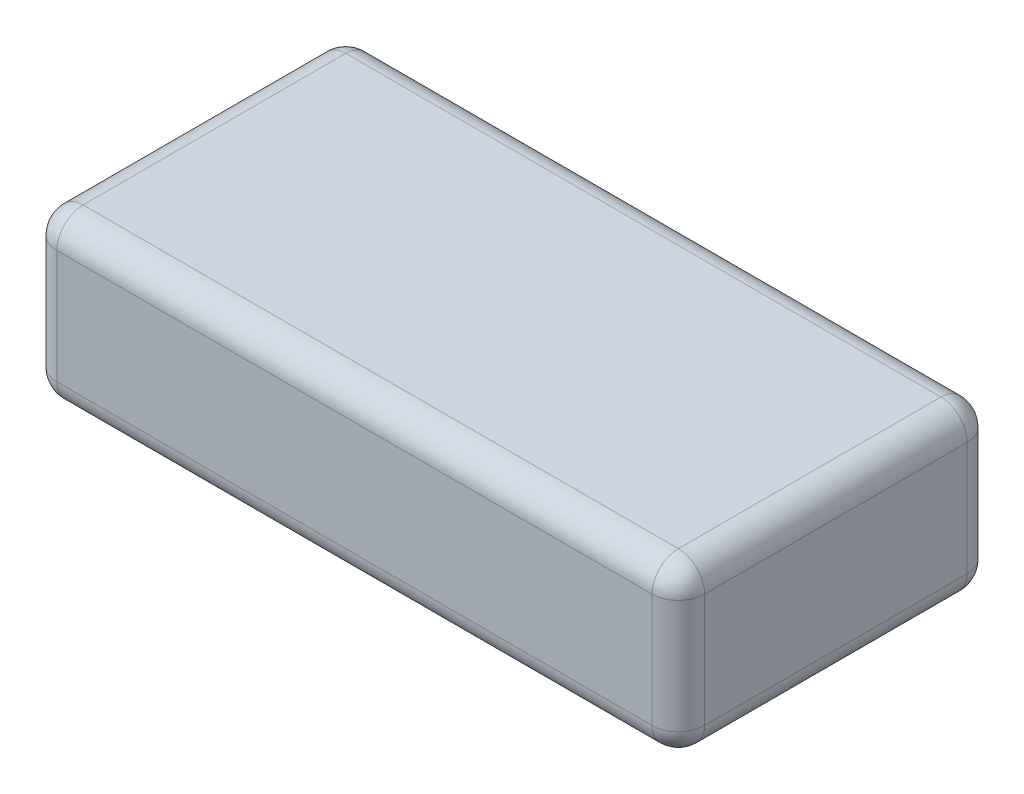
ISO-10303-21;
HEADER;
FILE_DESCRIPTION(('STEP AP214'),'2;1');
FILE_NAME('part.step','',(''),(''),'','','');
FILE_SCHEMA(('AUTOMOTIVE_DESIGN { 1 0 10303 214 1 1 1 1 }'));
ENDSEC;
DATA;
#1=APPLICATION_CONTEXT('core data for automotive mechanical design processes');
#2=APPLICATION_PROTOCOL_DEFINITION('international standard','automotive_design',2000,#1);
#3=PRODUCT_CONTEXT('',#1,'mechanical');
#4=PRODUCT('Part','Part','',(#3));
#5=PRODUCT_RELATED_PRODUCT_CATEGORY('part','',(#4));
#6=PRODUCT_DEFINITION_FORMATION('','',#4);
#7=PRODUCT_DEFINITION_CONTEXT('part definition',#1,'design');
#8=PRODUCT_DEFINITION('design','',#6,#7);
#9=PRODUCT_DEFINITION_SHAPE('','',#8);
#10=(LENGTH_UNIT() NAMED_UNIT(*) SI_UNIT(.MILLI.,.METRE.));
#11=(NAMED_UNIT(*) PLANE_ANGLE_UNIT() SI_UNIT($,.RADIAN.));
#12=(NAMED_UNIT(*) SI_UNIT($,.STERADIAN.) SOLID_ANGLE_UNIT());
#13=UNCERTAINTY_MEASURE_WITH_UNIT(LENGTH_MEASURE(1.E-05),#10,'distance_accuracy_value','');
#14=(GEOMETRIC_REPRESENTATION_CONTEXT(3) GLOBAL_UNCERTAINTY_ASSIGNED_CONTEXT((#13)) GLOBAL_UNIT_ASSIGNED_CONTEXT((#10,
#11,#12)) REPRESENTATION_CONTEXT('',''));
#15=CARTESIAN_POINT('',(0.,0.,0.));
#16=DIRECTION('',(0.,0.,1.));
#17=DIRECTION('',(1.,0.,0.));
#18=AXIS2_PLACEMENT_3D('',#15,#16,#17);
#19=CARTESIAN_POINT('',(37.,19.,18.));
#20=DIRECTION('',(-1.,0.,0.));
#21=DIRECTION('',(0.,0.,1.));
#22=AXIS2_PLACEMENT_3D('',#19,#20,#21);
#23=PLANE('',#22);
#24=DIRECTION('',(0.,0.,-1.));
#25=VECTOR('',#24,1.);
#26=CARTESIAN_POINT('',(37.,3.,-18.));
#27=LINE('',#26,#25);
#28=CARTESIAN_POINT('',(37.,3.,15.));
#29=VERTEX_POINT('',#28);
#30=CARTESIAN_POINT('',(37.,3.,-15.));
#31=VERTEX_POINT('',#30);
#32=EDGE_CURVE('E192',#29,#31,#27,.T.);
#33=ORIENTED_EDGE('',*,*,#32,.T.);
#34=DIRECTION('',(0.,-1.,0.));
#35=VECTOR('',#34,1.);
#36=CARTESIAN_POINT('',(37.,19.,-15.));
#37=LINE('',#36,#35);
#38=CARTESIAN_POINT('',(37.,16.,-15.));
#39=VERTEX_POINT('',#38);
#40=EDGE_CURVE('E195',#31,#39,#37,.F.);
#41=ORIENTED_EDGE('',*,*,#40,.T.);
#42=DIRECTION('',(0.,0.,-1.));
#43=VECTOR('',#42,1.);
#44=CARTESIAN_POINT('',(37.,16.,18.));
#45=LINE('',#44,#43);
#46=CARTESIAN_POINT('',(37.,16.,15.));
#47=VERTEX_POINT('',#46);
#48=EDGE_CURVE('E190',#39,#47,#45,.F.);
#49=ORIENTED_EDGE('',*,*,#48,.T.);
#50=DIRECTION('',(0.,-1.,0.));
#51=VECTOR('',#50,1.);
#52=CARTESIAN_POINT('',(37.,19.,15.));
#53=LINE('',#52,#51);
#54=EDGE_CURVE('E188',#47,#29,#53,.T.);
#55=ORIENTED_EDGE('',*,*,#54,.T.);
#56=EDGE_LOOP('',(#33,#41,#49,#55));
#57=FACE_BOUND('',#56,.T.);
#58=ADVANCED_FACE('F36',(#57),#23,.F.);
#59=CARTESIAN_POINT('',(-37.,19.,-18.));
#60=DIRECTION('',(0.,0.,1.));
#61=DIRECTION('',(1.,0.,0.));
#62=AXIS2_PLACEMENT_3D('',#59,#60,#61);
#63=PLANE('',#62);
#64=DIRECTION('',(-1.,0.,0.));
#65=VECTOR('',#64,1.);
#66=CARTESIAN_POINT('',(-37.,16.,-18.));
#67=LINE('',#66,#65);
#68=CARTESIAN_POINT('',(-34.,16.,-18.));
#69=VERTEX_POINT('',#68);
#70=CARTESIAN_POINT('',(34.,16.,-18.));
#71=VERTEX_POINT('',#70);
#72=EDGE_CURVE('E153',#69,#71,#67,.F.);
#73=ORIENTED_EDGE('',*,*,#72,.T.);
#74=DIRECTION('',(0.,-1.,0.));
#75=VECTOR('',#74,1.);
#76=CARTESIAN_POINT('',(34.,19.,-18.));
#77=LINE('',#76,#75);
#78=CARTESIAN_POINT('',(34.,3.,-18.));
#79=VERTEX_POINT('',#78);
#80=EDGE_CURVE('E157',#71,#79,#77,.T.);
#81=ORIENTED_EDGE('',*,*,#80,.T.);
#82=DIRECTION('',(-1.,0.,0.));
#83=VECTOR('',#82,1.);
#84=CARTESIAN_POINT('',(-37.,3.,-18.));
#85=LINE('',#84,#83);
#86=CARTESIAN_POINT('',(-34.,3.,-18.));
#87=VERTEX_POINT('',#86);
#88=EDGE_CURVE('E129',#79,#87,#85,.T.);
#89=ORIENTED_EDGE('',*,*,#88,.T.);
#90=DIRECTION('',(0.,-1.,0.));
#91=VECTOR('',#90,1.);
#92=CARTESIAN_POINT('',(-34.,19.,-18.));
#93=LINE('',#92,#91);
#94=EDGE_CURVE('E147',#87,#69,#93,.F.);
#95=ORIENTED_EDGE('',*,*,#94,.T.);
#96=EDGE_LOOP('',(#73,#81,#89,#95));
#97=FACE_BOUND('',#96,.T.);
#98=ADVANCED_FACE('F155',(#97),#63,.F.);
#99=CARTESIAN_POINT('',(-37.,19.,18.));
#100=DIRECTION('',(1.,0.,0.));
#101=DIRECTION('',(0.,0.,-1.));
#102=AXIS2_PLACEMENT_3D('',#99,#100,#101);
#103=PLANE('',#102);
#104=DIRECTION('',(0.,0.,1.));
#105=VECTOR('',#104,1.);
#106=CARTESIAN_POINT('',(-37.,16.,18.));
#107=LINE('',#106,#105);
#108=CARTESIAN_POINT('',(-37.,16.,15.));
#109=VERTEX_POINT('',#108);
#110=CARTESIAN_POINT('',(-37.,16.,-15.));
#111=VERTEX_POINT('',#110);
#112=EDGE_CURVE('E172',#109,#111,#107,.F.);
#113=ORIENTED_EDGE('',*,*,#112,.T.);
#114=DIRECTION('',(0.,-1.,0.));
#115=VECTOR('',#114,1.);
#116=CARTESIAN_POINT('',(-37.,19.,-15.));
#117=LINE('',#116,#115);
#118=CARTESIAN_POINT('',(-37.,3.,-15.));
#119=VERTEX_POINT('',#118);
#120=EDGE_CURVE('E177',#111,#119,#117,.T.);
#121=ORIENTED_EDGE('',*,*,#120,.T.);
#122=DIRECTION('',(0.,0.,1.));
#123=VECTOR('',#122,1.);
#124=CARTESIAN_POINT('',(-37.,3.,18.));
#125=LINE('',#124,#123);
#126=CARTESIAN_POINT('',(-37.,3.,15.));
#127=VERTEX_POINT('',#126);
#128=EDGE_CURVE('E174',#119,#127,#125,.T.);
#129=ORIENTED_EDGE('',*,*,#128,.T.);
#130=DIRECTION('',(0.,-1.,0.));
#131=VECTOR('',#130,1.);
#132=CARTESIAN_POINT('',(-37.,19.,15.));
#133=LINE('',#132,#131);
#134=EDGE_CURVE('E170',#127,#109,#133,.F.);
#135=ORIENTED_EDGE('',*,*,#134,.T.);
#136=EDGE_LOOP('',(#113,#121,#129,#135));
#137=FACE_BOUND('',#136,.T.);
#138=ADVANCED_FACE('F330',(#137),#103,.F.);
#139=CARTESIAN_POINT('',(-37.,19.,18.));
#140=DIRECTION('',(0.,0.,-1.));
#141=DIRECTION('',(-1.,0.,0.));
#142=AXIS2_PLACEMENT_3D('',#139,#140,#141);
#143=PLANE('',#142);
#144=DIRECTION('',(1.,0.,0.));
#145=VECTOR('',#144,1.);
#146=CARTESIAN_POINT('',(37.,3.,18.));
#147=LINE('',#146,#145);
#148=CARTESIAN_POINT('',(-34.,3.,18.));
#149=VERTEX_POINT('',#148);
#150=CARTESIAN_POINT('',(34.,3.,18.));
#151=VERTEX_POINT('',#150);
#152=EDGE_CURVE('E183',#149,#151,#147,.T.);
#153=ORIENTED_EDGE('',*,*,#152,.T.);
#154=DIRECTION('',(0.,-1.,0.));
#155=VECTOR('',#154,1.);
#156=CARTESIAN_POINT('',(34.,19.,18.));
#157=LINE('',#156,#155);
#158=CARTESIAN_POINT('',(34.,16.,18.));
#159=VERTEX_POINT('',#158);
#160=EDGE_CURVE('E186',#151,#159,#157,.F.);
#161=ORIENTED_EDGE('',*,*,#160,.T.);
#162=DIRECTION('',(1.,0.,0.));
#163=VECTOR('',#162,1.);
#164=CARTESIAN_POINT('',(-37.,16.,18.));
#165=LINE('',#164,#163);
#166=CARTESIAN_POINT('',(-34.,16.,18.));
#167=VERTEX_POINT('',#166);
#168=EDGE_CURVE('E181',#159,#167,#165,.F.);
#169=ORIENTED_EDGE('',*,*,#168,.T.);
#170=DIRECTION('',(0.,-1.,0.));
#171=VECTOR('',#170,1.);
#172=CARTESIAN_POINT('',(-34.,19.,18.));
#173=LINE('',#172,#171);
#174=EDGE_CURVE('E179',#167,#149,#173,.T.);
#175=ORIENTED_EDGE('',*,*,#174,.T.);
#176=EDGE_LOOP('',(#153,#161,#169,#175));
#177=FACE_BOUND('',#176,.T.);
#178=ADVANCED_FACE('F297',(#177),#143,.F.);
#179=CARTESIAN_POINT('',(0.,19.,0.));
#180=DIRECTION('',(0.,-1.,0.));
#181=DIRECTION('',(0.,0.,-1.));
#182=AXIS2_PLACEMENT_3D('',#179,#180,#181);
#183=PLANE('',#182);
#184=DIRECTION('',(0.,0.,1.));
#185=VECTOR('',#184,1.);
#186=CARTESIAN_POINT('',(-34.,19.,0.));
#187=LINE('',#186,#185);
#188=CARTESIAN_POINT('',(-34.,19.,-15.));
#189=VERTEX_POINT('',#188);
#190=CARTESIAN_POINT('',(-34.,19.,15.));
#191=VERTEX_POINT('',#190);
#192=EDGE_CURVE('E45',#189,#191,#187,.T.);
#193=ORIENTED_EDGE('',*,*,#192,.T.);
#194=DIRECTION('',(1.,0.,0.));
#195=VECTOR('',#194,1.);
#196=CARTESIAN_POINT('',(0.,19.,15.));
#197=LINE('',#196,#195);
#198=CARTESIAN_POINT('',(34.,19.,15.));
#199=VERTEX_POINT('',#198);
#200=EDGE_CURVE('E11',#191,#199,#197,.T.);
#201=ORIENTED_EDGE('',*,*,#200,.T.);
#202=DIRECTION('',(0.,0.,-1.));
#203=VECTOR('',#202,1.);
#204=CARTESIAN_POINT('',(34.,19.,0.));
#205=LINE('',#204,#203);
#206=CARTESIAN_POINT('',(34.,19.,-15.));
#207=VERTEX_POINT('',#206);
#208=EDGE_CURVE('E197',#199,#207,#205,.T.);
#209=ORIENTED_EDGE('',*,*,#208,.T.);
#210=DIRECTION('',(-1.,0.,0.));
#211=VECTOR('',#210,1.);
#212=CARTESIAN_POINT('',(0.,19.,-15.));
#213=LINE('',#212,#211);
#214=EDGE_CURVE('E56',#207,#189,#213,.T.);
#215=ORIENTED_EDGE('',*,*,#214,.T.);
#216=EDGE_LOOP('',(#193,#201,#209,#215));
#217=FACE_BOUND('',#216,.T.);
#218=ADVANCED_FACE('F277',(#217),#183,.F.);
#219=CARTESIAN_POINT('',(0.,0.,0.));
#220=DIRECTION('',(0.,-1.,0.));
#221=DIRECTION('',(0.,0.,-1.));
#222=AXIS2_PLACEMENT_3D('',#219,#220,#221);
#223=PLANE('',#222);
#224=DIRECTION('',(0.,0.,1.));
#225=VECTOR('',#224,1.);
#226=CARTESIAN_POINT('',(-34.,0.,-18.));
#227=LINE('',#226,#225);
#228=CARTESIAN_POINT('',(-34.,0.,15.));
#229=VERTEX_POINT('',#228);
#230=CARTESIAN_POINT('',(-34.,0.,-15.));
#231=VERTEX_POINT('',#230);
#232=EDGE_CURVE('E167',#229,#231,#227,.F.);
#233=ORIENTED_EDGE('',*,*,#232,.T.);
#234=DIRECTION('',(-1.,0.,0.));
#235=VECTOR('',#234,1.);
#236=CARTESIAN_POINT('',(37.,0.,-15.));
#237=LINE('',#236,#235);
#238=CARTESIAN_POINT('',(34.,0.,-15.));
#239=VERTEX_POINT('',#238);
#240=EDGE_CURVE('E131',#231,#239,#237,.F.);
#241=ORIENTED_EDGE('',*,*,#240,.T.);
#242=DIRECTION('',(0.,0.,-1.));
#243=VECTOR('',#242,1.);
#244=CARTESIAN_POINT('',(34.,0.,18.));
#245=LINE('',#244,#243);
#246=CARTESIAN_POINT('',(34.,0.,15.));
#247=VERTEX_POINT('',#246);
#248=EDGE_CURVE('E160',#239,#247,#245,.F.);
#249=ORIENTED_EDGE('',*,*,#248,.T.);
#250=DIRECTION('',(1.,0.,0.));
#251=VECTOR('',#250,1.);
#252=CARTESIAN_POINT('',(-37.,0.,15.));
#253=LINE('',#252,#251);
#254=EDGE_CURVE('E165',#247,#229,#253,.F.);
#255=ORIENTED_EDGE('',*,*,#254,.T.);
#256=EDGE_LOOP('',(#233,#241,#249,#255));
#257=FACE_BOUND('',#256,.T.);
#258=ADVANCED_FACE('F358',(#257),#223,.T.);
#259=CARTESIAN_POINT('',(0.,16.,15.));
#260=DIRECTION('',(1.,0.,0.));
#261=DIRECTION('',(0.,0.,-1.));
#262=AXIS2_PLACEMENT_3D('',#259,#260,#261);
#263=CYLINDRICAL_SURFACE('',#262,3.);
#264=CARTESIAN_POINT('',(34.,16.,15.));
#265=DIRECTION('',(1.,0.,0.));
#266=DIRECTION('',(0.,0.,-1.));
#267=AXIS2_PLACEMENT_3D('',#264,#265,#266);
#268=CIRCLE('',#267,3.);
#269=EDGE_CURVE('E40',#199,#159,#268,.T.);
#270=ORIENTED_EDGE('',*,*,#269,.F.);
#271=ORIENTED_EDGE('',*,*,#200,.F.);
#272=CARTESIAN_POINT('',(-34.,16.,15.));
#273=DIRECTION('',(-1.,0.,0.));
#274=DIRECTION('',(0.,0.,1.));
#275=AXIS2_PLACEMENT_3D('',#272,#273,#274);
#276=CIRCLE('',#275,3.);
#277=EDGE_CURVE('E250',#167,#191,#276,.T.);
#278=ORIENTED_EDGE('',*,*,#277,.F.);
#279=ORIENTED_EDGE('',*,*,#168,.F.);
#280=EDGE_LOOP('',(#270,#271,#278,#279));
#281=FACE_BOUND('',#280,.T.);
#282=ADVANCED_FACE('F38',(#281),#263,.T.);
#283=CARTESIAN_POINT('',(34.,16.,15.));
#284=DIRECTION('',(0.,0.,1.));
#285=DIRECTION('',(1.,0.,0.));
#286=AXIS2_PLACEMENT_3D('',#283,#284,#285);
#287=SPHERICAL_SURFACE('',#286,3.);
#288=CARTESIAN_POINT('',(34.,16.,15.));
#289=DIRECTION('',(0.,0.,1.));
#290=DIRECTION('',(1.,0.,0.));
#291=AXIS2_PLACEMENT_3D('',#288,#289,#290);
#292=CIRCLE('',#291,3.);
#293=EDGE_CURVE('E245',#199,#47,#292,.F.);
#294=ORIENTED_EDGE('',*,*,#293,.F.);
#295=ORIENTED_EDGE('',*,*,#269,.T.);
#296=CARTESIAN_POINT('',(34.,16.,15.));
#297=DIRECTION('',(0.,1.,0.));
#298=DIRECTION('',(0.,0.,1.));
#299=AXIS2_PLACEMENT_3D('',#296,#297,#298);
#300=CIRCLE('',#299,3.);
#301=EDGE_CURVE('E248',#47,#159,#300,.F.);
#302=ORIENTED_EDGE('',*,*,#301,.F.);
#303=EDGE_LOOP('',(#294,#295,#302));
#304=FACE_BOUND('',#303,.T.);
#305=ADVANCED_FACE('F261',(#304),#287,.T.);
#306=CARTESIAN_POINT('',(-34.,16.,15.));
#307=DIRECTION('',(0.,1.,0.));
#308=DIRECTION('',(0.,0.,1.));
#309=AXIS2_PLACEMENT_3D('',#306,#307,#308);
#310=SPHERICAL_SURFACE('',#309,3.);
#311=CARTESIAN_POINT('',(-34.,16.,15.));
#312=DIRECTION('',(0.,1.,0.));
#313=DIRECTION('',(0.,0.,1.));
#314=AXIS2_PLACEMENT_3D('',#311,#312,#313);
#315=CIRCLE('',#314,3.);
#316=EDGE_CURVE('E239',#167,#109,#315,.F.);
#317=ORIENTED_EDGE('',*,*,#316,.F.);
#318=ORIENTED_EDGE('',*,*,#277,.T.);
#319=CARTESIAN_POINT('',(-34.,16.,15.));
#320=DIRECTION('',(0.,0.,1.));
#321=DIRECTION('',(1.,0.,0.));
#322=AXIS2_PLACEMENT_3D('',#319,#320,#321);
#323=CIRCLE('',#322,3.);
#324=EDGE_CURVE('E242',#109,#191,#323,.F.);
#325=ORIENTED_EDGE('',*,*,#324,.F.);
#326=EDGE_LOOP('',(#317,#318,#325));
#327=FACE_BOUND('',#326,.T.);
#328=ADVANCED_FACE('F289',(#327),#310,.T.);
#329=CARTESIAN_POINT('',(34.,19.,15.));
#330=DIRECTION('',(0.,-1.,0.));
#331=DIRECTION('',(0.,0.,-1.));
#332=AXIS2_PLACEMENT_3D('',#329,#330,#331);
#333=CYLINDRICAL_SURFACE('',#332,3.);
#334=ORIENTED_EDGE('',*,*,#301,.T.);
#335=ORIENTED_EDGE('',*,*,#160,.F.);
#336=CARTESIAN_POINT('',(34.,3.,15.));
#337=DIRECTION('',(0.,-1.,0.));
#338=DIRECTION('',(0.,0.,-1.));
#339=AXIS2_PLACEMENT_3D('',#336,#337,#338);
#340=CIRCLE('',#339,3.);
#341=EDGE_CURVE('E234',#29,#151,#340,.T.);
#342=ORIENTED_EDGE('',*,*,#341,.F.);
#343=ORIENTED_EDGE('',*,*,#54,.F.);
#344=EDGE_LOOP('',(#334,#335,#342,#343));
#345=FACE_BOUND('',#344,.T.);
#346=ADVANCED_FACE('F267',(#345),#333,.T.);
#347=CARTESIAN_POINT('',(34.,16.,0.));
#348=DIRECTION('',(0.,0.,-1.));
#349=DIRECTION('',(-1.,0.,0.));
#350=AXIS2_PLACEMENT_3D('',#347,#348,#349);
#351=CYLINDRICAL_SURFACE('',#350,3.);
#352=ORIENTED_EDGE('',*,*,#293,.T.);
#353=ORIENTED_EDGE('',*,*,#48,.F.);
#354=CARTESIAN_POINT('',(34.,16.,-15.));
#355=DIRECTION('',(0.,0.,-1.));
#356=DIRECTION('',(-1.,0.,0.));
#357=AXIS2_PLACEMENT_3D('',#354,#355,#356);
#358=CIRCLE('',#357,3.);
#359=EDGE_CURVE('E231',#207,#39,#358,.T.);
#360=ORIENTED_EDGE('',*,*,#359,.F.);
#361=ORIENTED_EDGE('',*,*,#208,.F.);
#362=EDGE_LOOP('',(#352,#353,#360,#361));
#363=FACE_BOUND('',#362,.T.);
#364=ADVANCED_FACE('F276',(#363),#351,.T.);
#365=CARTESIAN_POINT('',(0.,16.,-15.));
#366=DIRECTION('',(-1.,0.,0.));
#367=DIRECTION('',(0.,0.,1.));
#368=AXIS2_PLACEMENT_3D('',#365,#366,#367);
#369=CYLINDRICAL_SURFACE('',#368,3.);
#370=CARTESIAN_POINT('',(-34.,16.,-15.));
#371=DIRECTION('',(-1.,0.,0.));
#372=DIRECTION('',(0.,0.,1.));
#373=AXIS2_PLACEMENT_3D('',#370,#371,#372);
#374=CIRCLE('',#373,3.);
#375=EDGE_CURVE('E225',#189,#69,#374,.T.);
#376=ORIENTED_EDGE('',*,*,#375,.F.);
#377=ORIENTED_EDGE('',*,*,#214,.F.);
#378=CARTESIAN_POINT('',(34.,16.,-15.));
#379=DIRECTION('',(1.,0.,0.));
#380=DIRECTION('',(0.,0.,-1.));
#381=AXIS2_PLACEMENT_3D('',#378,#379,#380);
#382=CIRCLE('',#381,3.);
#383=EDGE_CURVE('E228',#71,#207,#382,.T.);
#384=ORIENTED_EDGE('',*,*,#383,.F.);
#385=ORIENTED_EDGE('',*,*,#72,.F.);
#386=EDGE_LOOP('',(#376,#377,#384,#385));
#387=FACE_BOUND('',#386,.T.);
#388=ADVANCED_FACE('F281',(#387),#369,.T.);
#389=CARTESIAN_POINT('',(-34.,16.,0.));
#390=DIRECTION('',(0.,0.,1.));
#391=DIRECTION('',(1.,0.,0.));
#392=AXIS2_PLACEMENT_3D('',#389,#390,#391);
#393=CYLINDRICAL_SURFACE('',#392,3.);
#394=ORIENTED_EDGE('',*,*,#324,.T.);
#395=ORIENTED_EDGE('',*,*,#192,.F.);
#396=CARTESIAN_POINT('',(-34.,16.,-15.));
#397=DIRECTION('',(0.,0.,-1.));
#398=DIRECTION('',(0.,1.,0.));
#399=AXIS2_PLACEMENT_3D('',#396,#397,#398);
#400=CIRCLE('',#399,3.);
#401=EDGE_CURVE('E222',#111,#189,#400,.T.);
#402=ORIENTED_EDGE('',*,*,#401,.F.);
#403=ORIENTED_EDGE('',*,*,#112,.F.);
#404=EDGE_LOOP('',(#394,#395,#402,#403));
#405=FACE_BOUND('',#404,.T.);
#406=ADVANCED_FACE('F288',(#405),#393,.T.);
#407=CARTESIAN_POINT('',(-34.,19.,15.));
#408=DIRECTION('',(0.,-1.,0.));
#409=DIRECTION('',(0.,0.,-1.));
#410=AXIS2_PLACEMENT_3D('',#407,#408,#409);
#411=CYLINDRICAL_SURFACE('',#410,3.);
#412=ORIENTED_EDGE('',*,*,#316,.T.);
#413=ORIENTED_EDGE('',*,*,#134,.F.);
#414=CARTESIAN_POINT('',(-34.,3.,15.));
#415=DIRECTION('',(0.,-1.,0.));
#416=DIRECTION('',(0.,0.,-1.));
#417=AXIS2_PLACEMENT_3D('',#414,#415,#416);
#418=CIRCLE('',#417,3.);
#419=EDGE_CURVE('E219',#149,#127,#418,.T.);
#420=ORIENTED_EDGE('',*,*,#419,.F.);
#421=ORIENTED_EDGE('',*,*,#174,.F.);
#422=EDGE_LOOP('',(#412,#413,#420,#421));
#423=FACE_BOUND('',#422,.T.);
#424=ADVANCED_FACE('F294',(#423),#411,.T.);
#425=CARTESIAN_POINT('',(-37.,3.,15.));
#426=DIRECTION('',(-1.,0.,0.));
#427=DIRECTION('',(0.,0.,1.));
#428=AXIS2_PLACEMENT_3D('',#425,#426,#427);
#429=CYLINDRICAL_SURFACE('',#428,3.);
#430=CARTESIAN_POINT('',(34.,3.,15.));
#431=DIRECTION('',(1.,0.,0.));
#432=DIRECTION('',(0.,0.,-1.));
#433=AXIS2_PLACEMENT_3D('',#430,#431,#432);
#434=CIRCLE('',#433,3.);
#435=EDGE_CURVE('E236',#151,#247,#434,.T.);
#436=ORIENTED_EDGE('',*,*,#435,.F.);
#437=ORIENTED_EDGE('',*,*,#152,.F.);
#438=CARTESIAN_POINT('',(-34.,3.,15.));
#439=DIRECTION('',(-1.,0.,0.));
#440=DIRECTION('',(0.,0.,1.));
#441=AXIS2_PLACEMENT_3D('',#438,#439,#440);
#442=CIRCLE('',#441,3.);
#443=EDGE_CURVE('E216',#229,#149,#442,.T.);
#444=ORIENTED_EDGE('',*,*,#443,.F.);
#445=ORIENTED_EDGE('',*,*,#254,.F.);
#446=EDGE_LOOP('',(#436,#437,#444,#445));
#447=FACE_BOUND('',#446,.T.);
#448=ADVANCED_FACE('F301',(#447),#429,.T.);
#449=CARTESIAN_POINT('',(34.,3.,15.));
#450=DIRECTION('',(0.,0.,1.));
#451=DIRECTION('',(0.,-1.,0.));
#452=AXIS2_PLACEMENT_3D('',#449,#450,#451);
#453=SPHERICAL_SURFACE('',#452,3.);
#454=ORIENTED_EDGE('',*,*,#341,.T.);
#455=ORIENTED_EDGE('',*,*,#435,.T.);
#456=CARTESIAN_POINT('',(34.,3.,15.));
#457=DIRECTION('',(0.,0.,1.));
#458=DIRECTION('',(1.,0.,0.));
#459=AXIS2_PLACEMENT_3D('',#456,#457,#458);
#460=CIRCLE('',#459,3.);
#461=EDGE_CURVE('E213',#29,#247,#460,.F.);
#462=ORIENTED_EDGE('',*,*,#461,.F.);
#463=EDGE_LOOP('',(#454,#455,#462));
#464=FACE_BOUND('',#463,.T.);
#465=ADVANCED_FACE('F305',(#464),#453,.T.);
#466=CARTESIAN_POINT('',(34.,16.,-15.));
#467=DIRECTION('',(0.,1.,0.));
#468=DIRECTION('',(0.,0.,1.));
#469=AXIS2_PLACEMENT_3D('',#466,#467,#468);
#470=SPHERICAL_SURFACE('',#469,3.);
#471=ORIENTED_EDGE('',*,*,#383,.T.);
#472=ORIENTED_EDGE('',*,*,#359,.T.);
#473=CARTESIAN_POINT('',(34.,16.,-15.));
#474=DIRECTION('',(0.,1.,0.));
#475=DIRECTION('',(0.,0.,1.));
#476=AXIS2_PLACEMENT_3D('',#473,#474,#475);
#477=CIRCLE('',#476,3.);
#478=EDGE_CURVE('E210',#71,#39,#477,.F.);
#479=ORIENTED_EDGE('',*,*,#478,.F.);
#480=EDGE_LOOP('',(#471,#472,#479));
#481=FACE_BOUND('',#480,.T.);
#482=ADVANCED_FACE('F315',(#481),#470,.T.);
#483=CARTESIAN_POINT('',(-34.,16.,-15.));
#484=DIRECTION('',(0.,1.,0.));
#485=DIRECTION('',(0.,0.,1.));
#486=AXIS2_PLACEMENT_3D('',#483,#484,#485);
#487=SPHERICAL_SURFACE('',#486,3.);
#488=ORIENTED_EDGE('',*,*,#401,.T.);
#489=ORIENTED_EDGE('',*,*,#375,.T.);
#490=CARTESIAN_POINT('',(-34.,16.,-15.));
#491=DIRECTION('',(0.,1.,0.));
#492=DIRECTION('',(0.,0.,1.));
#493=AXIS2_PLACEMENT_3D('',#490,#491,#492);
#494=CIRCLE('',#493,3.);
#495=EDGE_CURVE('E150',#111,#69,#494,.F.);
#496=ORIENTED_EDGE('',*,*,#495,.F.);
#497=EDGE_LOOP('',(#488,#489,#496));
#498=FACE_BOUND('',#497,.T.);
#499=ADVANCED_FACE('F285',(#498),#487,.T.);
#500=CARTESIAN_POINT('',(-34.,3.,15.));
#501=DIRECTION('',(0.,0.,1.));
#502=DIRECTION('',(0.,-1.,0.));
#503=AXIS2_PLACEMENT_3D('',#500,#501,#502);
#504=SPHERICAL_SURFACE('',#503,3.);
#505=ORIENTED_EDGE('',*,*,#443,.T.);
#506=ORIENTED_EDGE('',*,*,#419,.T.);
#507=CARTESIAN_POINT('',(-34.,3.,15.));
#508=DIRECTION('',(0.,0.,1.));
#509=DIRECTION('',(1.,0.,0.));
#510=AXIS2_PLACEMENT_3D('',#507,#508,#509);
#511=CIRCLE('',#510,3.);
#512=EDGE_CURVE('E207',#229,#127,#511,.F.);
#513=ORIENTED_EDGE('',*,*,#512,.F.);
#514=EDGE_LOOP('',(#505,#506,#513));
#515=FACE_BOUND('',#514,.T.);
#516=ADVANCED_FACE('F322',(#515),#504,.T.);
#517=CARTESIAN_POINT('',(34.,3.,18.));
#518=DIRECTION('',(0.,0.,1.));
#519=DIRECTION('',(1.,0.,0.));
#520=AXIS2_PLACEMENT_3D('',#517,#518,#519);
#521=CYLINDRICAL_SURFACE('',#520,3.);
#522=ORIENTED_EDGE('',*,*,#461,.T.);
#523=ORIENTED_EDGE('',*,*,#248,.F.);
#524=CARTESIAN_POINT('',(34.,3.,-15.));
#525=DIRECTION('',(0.,0.,-1.));
#526=DIRECTION('',(-1.,0.,0.));
#527=AXIS2_PLACEMENT_3D('',#524,#525,#526);
#528=CIRCLE('',#527,3.);
#529=EDGE_CURVE('E204',#31,#239,#528,.T.);
#530=ORIENTED_EDGE('',*,*,#529,.F.);
#531=ORIENTED_EDGE('',*,*,#32,.F.);
#532=EDGE_LOOP('',(#522,#523,#530,#531));
#533=FACE_BOUND('',#532,.T.);
#534=ADVANCED_FACE('F308',(#533),#521,.T.);
#535=CARTESIAN_POINT('',(34.,19.,-15.));
#536=DIRECTION('',(0.,-1.,0.));
#537=DIRECTION('',(0.,0.,-1.));
#538=AXIS2_PLACEMENT_3D('',#535,#536,#537);
#539=CYLINDRICAL_SURFACE('',#538,3.);
#540=ORIENTED_EDGE('',*,*,#478,.T.);
#541=ORIENTED_EDGE('',*,*,#40,.F.);
#542=CARTESIAN_POINT('',(34.,3.,-15.));
#543=DIRECTION('',(0.,-1.,0.));
#544=DIRECTION('',(0.,0.,-1.));
#545=AXIS2_PLACEMENT_3D('',#542,#543,#544);
#546=CIRCLE('',#545,3.);
#547=EDGE_CURVE('E144',#79,#31,#546,.T.);
#548=ORIENTED_EDGE('',*,*,#547,.F.);
#549=ORIENTED_EDGE('',*,*,#80,.F.);
#550=EDGE_LOOP('',(#540,#541,#548,#549));
#551=FACE_BOUND('',#550,.T.);
#552=ADVANCED_FACE('F313',(#551),#539,.T.);
#553=CARTESIAN_POINT('',(-34.,19.,-15.));
#554=DIRECTION('',(0.,-1.,0.));
#555=DIRECTION('',(0.,0.,-1.));
#556=AXIS2_PLACEMENT_3D('',#553,#554,#555);
#557=CYLINDRICAL_SURFACE('',#556,3.);
#558=ORIENTED_EDGE('',*,*,#495,.T.);
#559=ORIENTED_EDGE('',*,*,#94,.F.);
#560=CARTESIAN_POINT('',(-34.,3.,-15.));
#561=DIRECTION('',(0.,-1.,0.));
#562=DIRECTION('',(0.,0.,-1.));
#563=AXIS2_PLACEMENT_3D('',#560,#561,#562);
#564=CIRCLE('',#563,3.);
#565=EDGE_CURVE('E137',#119,#87,#564,.T.);
#566=ORIENTED_EDGE('',*,*,#565,.F.);
#567=ORIENTED_EDGE('',*,*,#120,.F.);
#568=EDGE_LOOP('',(#558,#559,#566,#567));
#569=FACE_BOUND('',#568,.T.);
#570=ADVANCED_FACE('F148',(#569),#557,.T.);
#571=CARTESIAN_POINT('',(-34.,3.,18.));
#572=DIRECTION('',(0.,0.,-1.));
#573=DIRECTION('',(-1.,0.,0.));
#574=AXIS2_PLACEMENT_3D('',#571,#572,#573);
#575=CYLINDRICAL_SURFACE('',#574,3.);
#576=ORIENTED_EDGE('',*,*,#512,.T.);
#577=ORIENTED_EDGE('',*,*,#128,.F.);
#578=CARTESIAN_POINT('',(-34.,3.,-15.));
#579=DIRECTION('',(0.,0.,-1.));
#580=DIRECTION('',(-1.,0.,0.));
#581=AXIS2_PLACEMENT_3D('',#578,#579,#580);
#582=CIRCLE('',#581,3.);
#583=EDGE_CURVE('E141',#231,#119,#582,.T.);
#584=ORIENTED_EDGE('',*,*,#583,.F.);
#585=ORIENTED_EDGE('',*,*,#232,.F.);
#586=EDGE_LOOP('',(#576,#577,#584,#585));
#587=FACE_BOUND('',#586,.T.);
#588=ADVANCED_FACE('F341',(#587),#575,.T.);
#589=CARTESIAN_POINT('',(34.,3.,-15.));
#590=DIRECTION('',(1.,0.,0.));
#591=DIRECTION('',(0.,1.,0.));
#592=AXIS2_PLACEMENT_3D('',#589,#590,#591);
#593=SPHERICAL_SURFACE('',#592,3.);
#594=ORIENTED_EDGE('',*,*,#547,.T.);
#595=ORIENTED_EDGE('',*,*,#529,.T.);
#596=CARTESIAN_POINT('',(34.,3.,-15.));
#597=DIRECTION('',(1.,0.,0.));
#598=DIRECTION('',(0.,0.,-1.));
#599=AXIS2_PLACEMENT_3D('',#596,#597,#598);
#600=CIRCLE('',#599,3.);
#601=EDGE_CURVE('E134',#79,#239,#600,.F.);
#602=ORIENTED_EDGE('',*,*,#601,.F.);
#603=EDGE_LOOP('',(#594,#595,#602));
#604=FACE_BOUND('',#603,.T.);
#605=ADVANCED_FACE('F338',(#604),#593,.T.);
#606=CARTESIAN_POINT('',(-34.,3.,-15.));
#607=DIRECTION('',(-1.,0.,0.));
#608=DIRECTION('',(0.,0.,1.));
#609=AXIS2_PLACEMENT_3D('',#606,#607,#608);
#610=SPHERICAL_SURFACE('',#609,3.);
#611=ORIENTED_EDGE('',*,*,#583,.T.);
#612=ORIENTED_EDGE('',*,*,#565,.T.);
#613=CARTESIAN_POINT('',(-34.,3.,-15.));
#614=DIRECTION('',(-1.,0.,0.));
#615=DIRECTION('',(0.,0.,1.));
#616=AXIS2_PLACEMENT_3D('',#613,#614,#615);
#617=CIRCLE('',#616,3.);
#618=EDGE_CURVE('E125',#231,#87,#617,.F.);
#619=ORIENTED_EDGE('',*,*,#618,.F.);
#620=EDGE_LOOP('',(#611,#612,#619));
#621=FACE_BOUND('',#620,.T.);
#622=ADVANCED_FACE('F139',(#621),#610,.T.);
#623=CARTESIAN_POINT('',(-37.,3.,-15.));
#624=DIRECTION('',(1.,0.,0.));
#625=DIRECTION('',(0.,0.,-1.));
#626=AXIS2_PLACEMENT_3D('',#623,#624,#625);
#627=CYLINDRICAL_SURFACE('',#626,3.);
#628=ORIENTED_EDGE('',*,*,#601,.T.);
#629=ORIENTED_EDGE('',*,*,#240,.F.);
#630=ORIENTED_EDGE('',*,*,#618,.T.);
#631=ORIENTED_EDGE('',*,*,#88,.F.);
#632=EDGE_LOOP('',(#628,#629,#630,#631));
#633=FACE_BOUND('',#632,.T.);
#634=ADVANCED_FACE('F127',(#633),#627,.T.);
#635=CLOSED_SHELL('',(#58,#98,#138,#178,#218,#258,#282,#305,#328,#346,#364,#388,#406,#424,#448,
#465,#482,#499,#516,#534,#552,#570,#588,#605,#622,#634));
#636=MANIFOLD_SOLID_BREP('B2',#635);
#637=ADVANCED_BREP_SHAPE_REPRESENTATION('',(#18,#636),#14);
#638=SHAPE_DEFINITION_REPRESENTATION(#9,#637);
ENDSEC;
END-ISO-10303-21;
